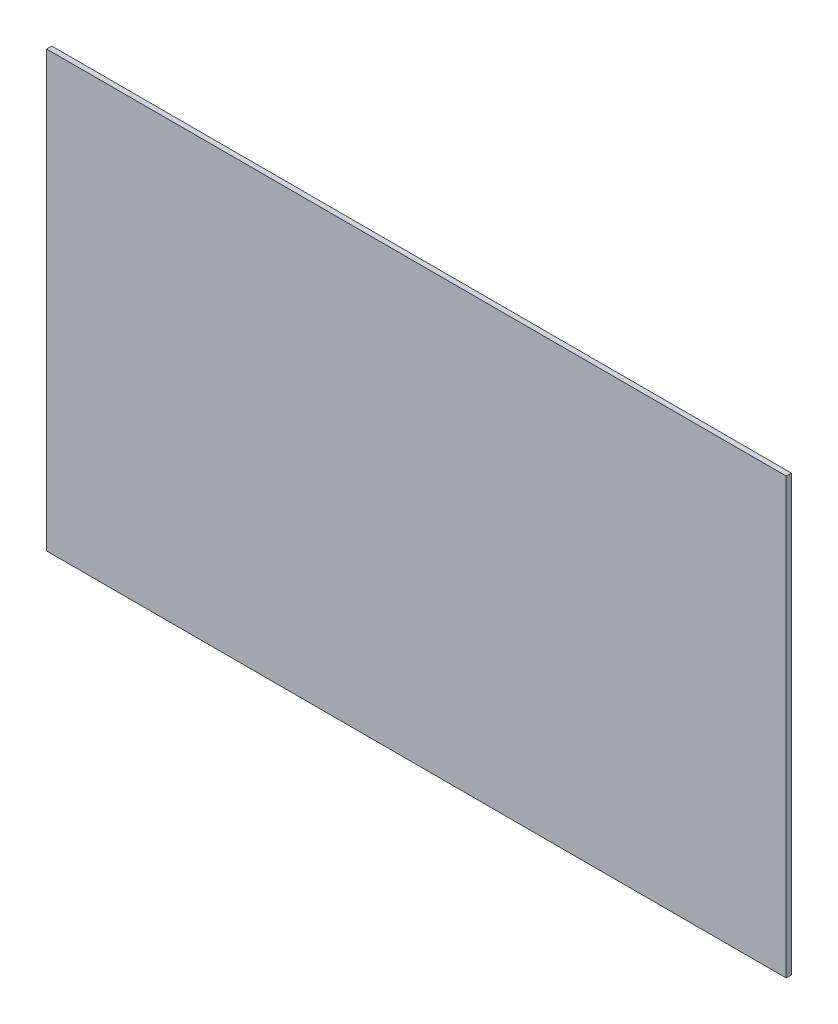
ISO-10303-21;
HEADER;
FILE_DESCRIPTION(('STEP AP214'),'2;1');
FILE_NAME('part.step','',(''),(''),'','','');
FILE_SCHEMA(('AUTOMOTIVE_DESIGN { 1 0 10303 214 1 1 1 1 }'));
ENDSEC;
DATA;
#1=APPLICATION_CONTEXT('core data for automotive mechanical design processes');
#2=APPLICATION_PROTOCOL_DEFINITION('international standard','automotive_design',2000,#1);
#3=PRODUCT_CONTEXT('',#1,'mechanical');
#4=PRODUCT('Part','Part','',(#3));
#5=PRODUCT_RELATED_PRODUCT_CATEGORY('part','',(#4));
#6=PRODUCT_DEFINITION_FORMATION('','',#4);
#7=PRODUCT_DEFINITION_CONTEXT('part definition',#1,'design');
#8=PRODUCT_DEFINITION('design','',#6,#7);
#9=PRODUCT_DEFINITION_SHAPE('','',#8);
#10=(LENGTH_UNIT() NAMED_UNIT(*) SI_UNIT(.MILLI.,.METRE.));
#11=(NAMED_UNIT(*) PLANE_ANGLE_UNIT() SI_UNIT($,.RADIAN.));
#12=(NAMED_UNIT(*) SI_UNIT($,.STERADIAN.) SOLID_ANGLE_UNIT());
#13=UNCERTAINTY_MEASURE_WITH_UNIT(LENGTH_MEASURE(1.E-05),#10,'distance_accuracy_value','');
#14=(GEOMETRIC_REPRESENTATION_CONTEXT(3) GLOBAL_UNCERTAINTY_ASSIGNED_CONTEXT((#13)) GLOBAL_UNIT_ASSIGNED_CONTEXT((#10,
#11,#12)) REPRESENTATION_CONTEXT('',''));
#15=CARTESIAN_POINT('',(0.,0.,0.));
#16=DIRECTION('',(0.,0.,1.));
#17=DIRECTION('',(1.,0.,0.));
#18=AXIS2_PLACEMENT_3D('',#15,#16,#17);
#19=CARTESIAN_POINT('',(0.,0.,2.54));
#20=DIRECTION('',(1.,0.,0.));
#21=DIRECTION('',(0.,0.,-1.));
#22=AXIS2_PLACEMENT_3D('',#19,#20,#21);
#23=PLANE('',#22);
#24=DIRECTION('',(0.,-1.,0.));
#25=VECTOR('',#24,1.);
#26=CARTESIAN_POINT('',(0.,0.,-2.54));
#27=LINE('',#26,#25);
#28=CARTESIAN_POINT('',(0.,425.45,-2.54));
#29=VERTEX_POINT('',#28);
#30=CARTESIAN_POINT('',(0.,0.,-2.54));
#31=VERTEX_POINT('',#30);
#32=EDGE_CURVE('E94',#29,#31,#27,.T.);
#33=ORIENTED_EDGE('',*,*,#32,.T.);
#34=DIRECTION('',(0.,0.,-1.));
#35=VECTOR('',#34,1.);
#36=CARTESIAN_POINT('',(0.,0.,2.54));
#37=LINE('',#36,#35);
#38=CARTESIAN_POINT('',(0.,0.,2.54));
#39=VERTEX_POINT('',#38);
#40=EDGE_CURVE('E11',#39,#31,#37,.T.);
#41=ORIENTED_EDGE('',*,*,#40,.F.);
#42=DIRECTION('',(0.,-1.,0.));
#43=VECTOR('',#42,1.);
#44=CARTESIAN_POINT('',(0.,0.,2.54));
#45=LINE('',#44,#43);
#46=CARTESIAN_POINT('',(0.,425.45,2.54));
#47=VERTEX_POINT('',#46);
#48=EDGE_CURVE('E82',#47,#39,#45,.T.);
#49=ORIENTED_EDGE('',*,*,#48,.F.);
#50=DIRECTION('',(0.,0.,-1.));
#51=VECTOR('',#50,1.);
#52=CARTESIAN_POINT('',(0.,425.45,2.54));
#53=LINE('',#52,#51);
#54=EDGE_CURVE('E90',#47,#29,#53,.T.);
#55=ORIENTED_EDGE('',*,*,#54,.T.);
#56=EDGE_LOOP('',(#33,#41,#49,#55));
#57=FACE_BOUND('',#56,.T.);
#58=ADVANCED_FACE('F31',(#57),#23,.F.);
#59=CARTESIAN_POINT('',(0.,0.,2.54));
#60=DIRECTION('',(0.,1.,0.));
#61=DIRECTION('',(0.,0.,1.));
#62=AXIS2_PLACEMENT_3D('',#59,#60,#61);
#63=PLANE('',#62);
#64=DIRECTION('',(1.,0.,0.));
#65=VECTOR('',#64,1.);
#66=CARTESIAN_POINT('',(0.,0.,-2.54));
#67=LINE('',#66,#65);
#68=CARTESIAN_POINT('',(723.9,0.,-2.54));
#69=VERTEX_POINT('',#68);
#70=EDGE_CURVE('E86',#31,#69,#67,.T.);
#71=ORIENTED_EDGE('',*,*,#70,.T.);
#72=DIRECTION('',(0.,0.,-1.));
#73=VECTOR('',#72,1.);
#74=CARTESIAN_POINT('',(723.9,0.,2.54));
#75=LINE('',#74,#73);
#76=CARTESIAN_POINT('',(723.9,0.,2.54));
#77=VERTEX_POINT('',#76);
#78=EDGE_CURVE('E39',#77,#69,#75,.T.);
#79=ORIENTED_EDGE('',*,*,#78,.F.);
#80=DIRECTION('',(1.,0.,0.));
#81=VECTOR('',#80,1.);
#82=CARTESIAN_POINT('',(0.,0.,2.54));
#83=LINE('',#82,#81);
#84=EDGE_CURVE('E77',#39,#77,#83,.T.);
#85=ORIENTED_EDGE('',*,*,#84,.F.);
#86=ORIENTED_EDGE('',*,*,#40,.T.);
#87=EDGE_LOOP('',(#71,#79,#85,#86));
#88=FACE_BOUND('',#87,.T.);
#89=ADVANCED_FACE('F85',(#88),#63,.F.);
#90=CARTESIAN_POINT('',(723.9,0.,2.54));
#91=DIRECTION('',(-1.,0.,0.));
#92=DIRECTION('',(0.,0.,1.));
#93=AXIS2_PLACEMENT_3D('',#90,#91,#92);
#94=PLANE('',#93);
#95=DIRECTION('',(0.,1.,0.));
#96=VECTOR('',#95,1.);
#97=CARTESIAN_POINT('',(723.9,0.,-2.54));
#98=LINE('',#97,#96);
#99=CARTESIAN_POINT('',(723.9,425.45,-2.54));
#100=VERTEX_POINT('',#99);
#101=EDGE_CURVE('E64',#69,#100,#98,.T.);
#102=ORIENTED_EDGE('',*,*,#101,.T.);
#103=DIRECTION('',(0.,0.,-1.));
#104=VECTOR('',#103,1.);
#105=CARTESIAN_POINT('',(723.9,425.45,2.54));
#106=LINE('',#105,#104);
#107=CARTESIAN_POINT('',(723.9,425.45,2.54));
#108=VERTEX_POINT('',#107);
#109=EDGE_CURVE('E87',#108,#100,#106,.T.);
#110=ORIENTED_EDGE('',*,*,#109,.F.);
#111=DIRECTION('',(0.,1.,0.));
#112=VECTOR('',#111,1.);
#113=CARTESIAN_POINT('',(723.9,0.,2.54));
#114=LINE('',#113,#112);
#115=EDGE_CURVE('E80',#77,#108,#114,.T.);
#116=ORIENTED_EDGE('',*,*,#115,.F.);
#117=ORIENTED_EDGE('',*,*,#78,.T.);
#118=EDGE_LOOP('',(#102,#110,#116,#117));
#119=FACE_BOUND('',#118,.T.);
#120=ADVANCED_FACE('F88',(#119),#94,.F.);
#121=CARTESIAN_POINT('',(0.,425.45,2.54));
#122=DIRECTION('',(0.,-1.,0.));
#123=DIRECTION('',(0.,0.,-1.));
#124=AXIS2_PLACEMENT_3D('',#121,#122,#123);
#125=PLANE('',#124);
#126=DIRECTION('',(-1.,0.,0.));
#127=VECTOR('',#126,1.);
#128=CARTESIAN_POINT('',(0.,425.45,-2.54));
#129=LINE('',#128,#127);
#130=EDGE_CURVE('E70',#100,#29,#129,.T.);
#131=ORIENTED_EDGE('',*,*,#130,.T.);
#132=ORIENTED_EDGE('',*,*,#54,.F.);
#133=DIRECTION('',(-1.,0.,0.));
#134=VECTOR('',#133,1.);
#135=CARTESIAN_POINT('',(0.,425.45,2.54));
#136=LINE('',#135,#134);
#137=EDGE_CURVE('E47',#108,#47,#136,.T.);
#138=ORIENTED_EDGE('',*,*,#137,.F.);
#139=ORIENTED_EDGE('',*,*,#109,.T.);
#140=EDGE_LOOP('',(#131,#132,#138,#139));
#141=FACE_BOUND('',#140,.T.);
#142=ADVANCED_FACE('F101',(#141),#125,.F.);
#143=CARTESIAN_POINT('',(0.,425.45,2.54));
#144=DIRECTION('',(0.,0.,-1.));
#145=DIRECTION('',(-1.,0.,0.));
#146=AXIS2_PLACEMENT_3D('',#143,#144,#145);
#147=PLANE('',#146);
#148=ORIENTED_EDGE('',*,*,#48,.T.);
#149=ORIENTED_EDGE('',*,*,#84,.T.);
#150=ORIENTED_EDGE('',*,*,#115,.T.);
#151=ORIENTED_EDGE('',*,*,#137,.T.);
#152=EDGE_LOOP('',(#148,#149,#150,#151));
#153=FACE_BOUND('',#152,.T.);
#154=ADVANCED_FACE('F78',(#153),#147,.F.);
#155=CARTESIAN_POINT('',(0.,425.45,-2.54));
#156=DIRECTION('',(0.,0.,-1.));
#157=DIRECTION('',(-1.,0.,0.));
#158=AXIS2_PLACEMENT_3D('',#155,#156,#157);
#159=PLANE('',#158);
#160=ORIENTED_EDGE('',*,*,#32,.F.);
#161=ORIENTED_EDGE('',*,*,#130,.F.);
#162=ORIENTED_EDGE('',*,*,#101,.F.);
#163=ORIENTED_EDGE('',*,*,#70,.F.);
#164=EDGE_LOOP('',(#160,#161,#162,#163));
#165=FACE_BOUND('',#164,.T.);
#166=ADVANCED_FACE('F104',(#165),#159,.T.);
#167=CLOSED_SHELL('',(#58,#89,#120,#142,#154,#166));
#168=MANIFOLD_SOLID_BREP('B2',#167);
#169=ADVANCED_BREP_SHAPE_REPRESENTATION('',(#18,#168),#14);
#170=SHAPE_DEFINITION_REPRESENTATION(#9,#169);
ENDSEC;
END-ISO-10303-21;
